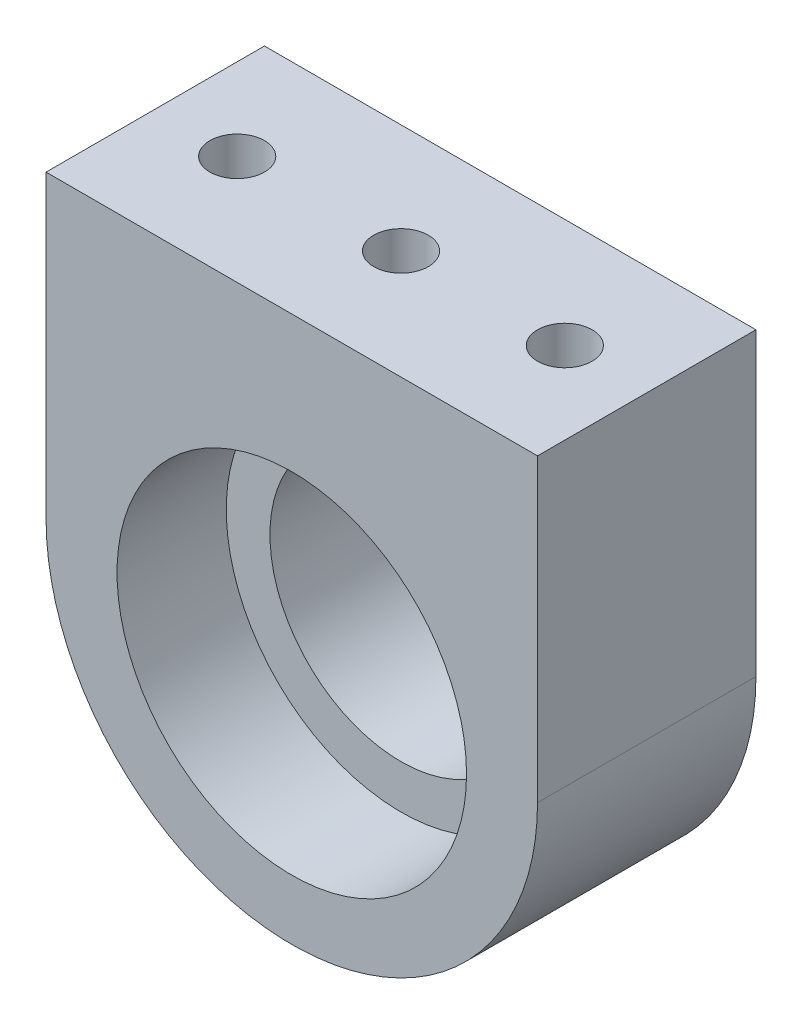
ISO-10303-21;
HEADER;
FILE_DESCRIPTION(('STEP AP214'),'2;1');
FILE_NAME('part.step','',(''),(''),'','','');
FILE_SCHEMA(('AUTOMOTIVE_DESIGN { 1 0 10303 214 1 1 1 1 }'));
ENDSEC;
DATA;
#1=APPLICATION_CONTEXT('core data for automotive mechanical design processes');
#2=APPLICATION_PROTOCOL_DEFINITION('international standard','automotive_design',2000,#1);
#3=PRODUCT_CONTEXT('',#1,'mechanical');
#4=PRODUCT('Part','Part','',(#3));
#5=PRODUCT_RELATED_PRODUCT_CATEGORY('part','',(#4));
#6=PRODUCT_DEFINITION_FORMATION('','',#4);
#7=PRODUCT_DEFINITION_CONTEXT('part definition',#1,'design');
#8=PRODUCT_DEFINITION('design','',#6,#7);
#9=PRODUCT_DEFINITION_SHAPE('','',#8);
#10=(LENGTH_UNIT() NAMED_UNIT(*) SI_UNIT(.MILLI.,.METRE.));
#11=(NAMED_UNIT(*) PLANE_ANGLE_UNIT() SI_UNIT($,.RADIAN.));
#12=(NAMED_UNIT(*) SI_UNIT($,.STERADIAN.) SOLID_ANGLE_UNIT());
#13=UNCERTAINTY_MEASURE_WITH_UNIT(LENGTH_MEASURE(1.E-05),#10,'distance_accuracy_value','');
#14=(GEOMETRIC_REPRESENTATION_CONTEXT(3) GLOBAL_UNCERTAINTY_ASSIGNED_CONTEXT((#13)) GLOBAL_UNIT_ASSIGNED_CONTEXT((#10,
#11,#12)) REPRESENTATION_CONTEXT('',''));
#15=CARTESIAN_POINT('',(0.,0.,0.));
#16=DIRECTION('',(0.,0.,1.));
#17=DIRECTION('',(1.,0.,0.));
#18=AXIS2_PLACEMENT_3D('',#15,#16,#17);
#19=CARTESIAN_POINT('',(0.,0.,10.));
#20=DIRECTION('',(0.,0.,-1.));
#21=DIRECTION('',(-1.,0.,0.));
#22=AXIS2_PLACEMENT_3D('',#19,#20,#21);
#23=PLANE('',#22);
#24=CARTESIAN_POINT('',(15.,16.75,10.));
#25=DIRECTION('',(0.,0.,1.));
#26=DIRECTION('',(1.,0.,0.));
#27=AXIS2_PLACEMENT_3D('',#24,#25,#26);
#28=CIRCLE('',#27,8.);
#29=CARTESIAN_POINT('',(23.,16.75,10.));
#30=VERTEX_POINT('',#29);
#31=EDGE_CURVE('E49',#30,#30,#28,.T.);
#32=ORIENTED_EDGE('',*,*,#31,.F.);
#33=EDGE_LOOP('',(#32));
#34=FACE_BOUND('',#33,.T.);
#35=DIRECTION('',(-1.,0.,0.));
#36=VECTOR('',#35,1.);
#37=CARTESIAN_POINT('',(26.25,31.,10.));
#38=LINE('',#37,#36);
#39=CARTESIAN_POINT('',(26.25,31.,10.));
#40=VERTEX_POINT('',#39);
#41=CARTESIAN_POINT('',(3.75000000000078,31.,10.));
#42=VERTEX_POINT('',#41);
#43=EDGE_CURVE('E117',#40,#42,#38,.T.);
#44=ORIENTED_EDGE('',*,*,#43,.T.);
#45=DIRECTION('',(0.,-1.,0.));
#46=VECTOR('',#45,1.);
#47=CARTESIAN_POINT('',(3.75000000000078,31.,10.));
#48=LINE('',#47,#46);
#49=CARTESIAN_POINT('',(3.75000000000078,17.2499999999996,10.));
#50=VERTEX_POINT('',#49);
#51=EDGE_CURVE('E132',#42,#50,#48,.T.);
#52=ORIENTED_EDGE('',*,*,#51,.T.);
#53=CARTESIAN_POINT('',(15.0000000000004,17.2499999999996,10.));
#54=DIRECTION('',(0.,0.,1.));
#55=DIRECTION('',(1.,0.,0.));
#56=AXIS2_PLACEMENT_3D('',#53,#54,#55);
#57=CIRCLE('',#56,11.2499999999996);
#58=CARTESIAN_POINT('',(26.25,17.2499999999996,10.));
#59=VERTEX_POINT('',#58);
#60=EDGE_CURVE('E57',#50,#59,#57,.T.);
#61=ORIENTED_EDGE('',*,*,#60,.T.);
#62=DIRECTION('',(0.,1.,0.));
#63=VECTOR('',#62,1.);
#64=CARTESIAN_POINT('',(26.25,17.2499999999996,10.));
#65=LINE('',#64,#63);
#66=EDGE_CURVE('E120',#59,#40,#65,.T.);
#67=ORIENTED_EDGE('',*,*,#66,.T.);
#68=EDGE_LOOP('',(#44,#52,#61,#67));
#69=FACE_BOUND('',#68,.T.);
#70=ADVANCED_FACE('F40',(#34,#69),#23,.F.);
#71=CARTESIAN_POINT('',(0.,0.,0.));
#72=DIRECTION('',(0.,0.,-1.));
#73=DIRECTION('',(-1.,0.,0.));
#74=AXIS2_PLACEMENT_3D('',#71,#72,#73);
#75=PLANE('',#74);
#76=CARTESIAN_POINT('',(15.,16.75,0.));
#77=DIRECTION('',(0.,0.,-1.));
#78=DIRECTION('',(-1.,0.,0.));
#79=AXIS2_PLACEMENT_3D('',#76,#77,#78);
#80=CIRCLE('',#79,6.);
#81=CARTESIAN_POINT('',(9.,16.75,0.));
#82=VERTEX_POINT('',#81);
#83=EDGE_CURVE('E44',#82,#82,#80,.T.);
#84=ORIENTED_EDGE('',*,*,#83,.F.);
#85=EDGE_LOOP('',(#84));
#86=FACE_BOUND('',#85,.T.);
#87=DIRECTION('',(0.,-1.,0.));
#88=VECTOR('',#87,1.);
#89=CARTESIAN_POINT('',(3.75000000000078,31.,0.));
#90=LINE('',#89,#88);
#91=CARTESIAN_POINT('',(3.75000000000078,31.,0.));
#92=VERTEX_POINT('',#91);
#93=CARTESIAN_POINT('',(3.75000000000078,17.2499999999996,0.));
#94=VERTEX_POINT('',#93);
#95=EDGE_CURVE('E119',#92,#94,#90,.T.);
#96=ORIENTED_EDGE('',*,*,#95,.F.);
#97=DIRECTION('',(-1.,0.,0.));
#98=VECTOR('',#97,1.);
#99=CARTESIAN_POINT('',(26.25,31.,0.));
#100=LINE('',#99,#98);
#101=CARTESIAN_POINT('',(26.25,31.,0.));
#102=VERTEX_POINT('',#101);
#103=EDGE_CURVE('E65',#102,#92,#100,.T.);
#104=ORIENTED_EDGE('',*,*,#103,.F.);
#105=DIRECTION('',(0.,1.,0.));
#106=VECTOR('',#105,1.);
#107=CARTESIAN_POINT('',(26.25,17.2499999999996,0.));
#108=LINE('',#107,#106);
#109=CARTESIAN_POINT('',(26.25,17.2499999999996,0.));
#110=VERTEX_POINT('',#109);
#111=EDGE_CURVE('E126',#110,#102,#108,.T.);
#112=ORIENTED_EDGE('',*,*,#111,.F.);
#113=CARTESIAN_POINT('',(15.0000000000004,17.2499999999996,0.));
#114=DIRECTION('',(0.,0.,1.));
#115=DIRECTION('',(1.,0.,0.));
#116=AXIS2_PLACEMENT_3D('',#113,#114,#115);
#117=CIRCLE('',#116,11.2499999999996);
#118=EDGE_CURVE('E123',#94,#110,#117,.T.);
#119=ORIENTED_EDGE('',*,*,#118,.F.);
#120=EDGE_LOOP('',(#96,#104,#112,#119));
#121=FACE_BOUND('',#120,.T.);
#122=ADVANCED_FACE('F42',(#86,#121),#75,.T.);
#123=CARTESIAN_POINT('',(15.,16.75,5.));
#124=DIRECTION('',(0.,0.,1.));
#125=DIRECTION('',(1.,0.,0.));
#126=AXIS2_PLACEMENT_3D('',#123,#124,#125);
#127=CYLINDRICAL_SURFACE('',#126,8.);
#128=CARTESIAN_POINT('',(15.,16.75,5.));
#129=DIRECTION('',(0.,0.,1.));
#130=DIRECTION('',(1.,0.,0.));
#131=AXIS2_PLACEMENT_3D('',#128,#129,#130);
#132=CIRCLE('',#131,8.);
#133=CARTESIAN_POINT('',(23.,16.75,5.));
#134=VERTEX_POINT('',#133);
#135=EDGE_CURVE('E11',#134,#134,#132,.T.);
#136=ORIENTED_EDGE('',*,*,#135,.F.);
#137=EDGE_LOOP('',(#136));
#138=FACE_BOUND('',#137,.T.);
#139=ORIENTED_EDGE('',*,*,#31,.T.);
#140=EDGE_LOOP('',(#139));
#141=FACE_BOUND('',#140,.T.);
#142=ADVANCED_FACE('F158',(#138,#141),#127,.F.);
#143=CARTESIAN_POINT('',(15.,16.75,5.));
#144=DIRECTION('',(0.,0.,1.));
#145=DIRECTION('',(1.,0.,0.));
#146=AXIS2_PLACEMENT_3D('',#143,#144,#145);
#147=PLANE('',#146);
#148=CARTESIAN_POINT('',(15.,16.75,5.));
#149=DIRECTION('',(0.,0.,1.));
#150=DIRECTION('',(1.,0.,0.));
#151=AXIS2_PLACEMENT_3D('',#148,#149,#150);
#152=CIRCLE('',#151,6.);
#153=CARTESIAN_POINT('',(21.,16.75,5.));
#154=VERTEX_POINT('',#153);
#155=EDGE_CURVE('E140',#154,#154,#152,.T.);
#156=ORIENTED_EDGE('',*,*,#155,.F.);
#157=EDGE_LOOP('',(#156));
#158=FACE_BOUND('',#157,.T.);
#159=ORIENTED_EDGE('',*,*,#135,.T.);
#160=EDGE_LOOP('',(#159));
#161=FACE_BOUND('',#160,.T.);
#162=ADVANCED_FACE('F188',(#158,#161),#147,.T.);
#163=CARTESIAN_POINT('',(15.,16.75,-5.));
#164=DIRECTION('',(0.,0.,1.));
#165=DIRECTION('',(1.,0.,0.));
#166=AXIS2_PLACEMENT_3D('',#163,#164,#165);
#167=CYLINDRICAL_SURFACE('',#166,6.);
#168=ORIENTED_EDGE('',*,*,#83,.T.);
#169=EDGE_LOOP('',(#168));
#170=FACE_BOUND('',#169,.T.);
#171=ORIENTED_EDGE('',*,*,#155,.T.);
#172=EDGE_LOOP('',(#171));
#173=FACE_BOUND('',#172,.T.);
#174=ADVANCED_FACE('F153',(#170,#173),#167,.F.);
#175=CARTESIAN_POINT('',(26.25,31.,0.));
#176=DIRECTION('',(0.,1.,0.));
#177=DIRECTION('',(0.,0.,1.));
#178=AXIS2_PLACEMENT_3D('',#175,#176,#177);
#179=PLANE('',#178);
#180=CARTESIAN_POINT('',(7.50000000000078,31.,5.));
#181=DIRECTION('',(0.,1.,0.));
#182=DIRECTION('',(0.,0.,1.));
#183=AXIS2_PLACEMENT_3D('',#180,#181,#182);
#184=CIRCLE('',#183,1.24999999999999);
#185=CARTESIAN_POINT('',(7.50000000000078,31.,6.24999999999999));
#186=VERTEX_POINT('',#185);
#187=EDGE_CURVE('E101',#186,#186,#184,.T.);
#188=ORIENTED_EDGE('',*,*,#187,.F.);
#189=EDGE_LOOP('',(#188));
#190=FACE_BOUND('',#189,.T.);
#191=CARTESIAN_POINT('',(15.0000000000008,31.,5.));
#192=DIRECTION('',(0.,1.,0.));
#193=DIRECTION('',(0.,0.,1.));
#194=AXIS2_PLACEMENT_3D('',#191,#192,#193);
#195=CIRCLE('',#194,1.24999999999999);
#196=CARTESIAN_POINT('',(15.0000000000008,31.,6.24999999999999));
#197=VERTEX_POINT('',#196);
#198=EDGE_CURVE('E100',#197,#197,#195,.T.);
#199=ORIENTED_EDGE('',*,*,#198,.F.);
#200=EDGE_LOOP('',(#199));
#201=FACE_BOUND('',#200,.T.);
#202=CARTESIAN_POINT('',(22.5,31.,5.));
#203=DIRECTION('',(0.,1.,0.));
#204=DIRECTION('',(0.,0.,1.));
#205=AXIS2_PLACEMENT_3D('',#202,#203,#204);
#206=CIRCLE('',#205,1.24999999999999);
#207=CARTESIAN_POINT('',(22.5,31.,6.24999999999999));
#208=VERTEX_POINT('',#207);
#209=EDGE_CURVE('E111',#208,#208,#206,.T.);
#210=ORIENTED_EDGE('',*,*,#209,.F.);
#211=EDGE_LOOP('',(#210));
#212=FACE_BOUND('',#211,.T.);
#213=ORIENTED_EDGE('',*,*,#43,.F.);
#214=DIRECTION('',(0.,0.,1.));
#215=VECTOR('',#214,1.);
#216=CARTESIAN_POINT('',(26.25,31.,0.));
#217=LINE('',#216,#215);
#218=EDGE_CURVE('E138',#102,#40,#217,.T.);
#219=ORIENTED_EDGE('',*,*,#218,.F.);
#220=ORIENTED_EDGE('',*,*,#103,.T.);
#221=DIRECTION('',(0.,0.,1.));
#222=VECTOR('',#221,1.);
#223=CARTESIAN_POINT('',(3.75000000000078,31.,0.));
#224=LINE('',#223,#222);
#225=EDGE_CURVE('E129',#92,#42,#224,.T.);
#226=ORIENTED_EDGE('',*,*,#225,.T.);
#227=EDGE_LOOP('',(#213,#219,#220,#226));
#228=FACE_BOUND('',#227,.T.);
#229=ADVANCED_FACE('F166',(#190,#201,#212,#228),#179,.T.);
#230=CARTESIAN_POINT('',(26.25,17.2499999999996,0.));
#231=DIRECTION('',(1.,0.,0.));
#232=DIRECTION('',(0.,1.,0.));
#233=AXIS2_PLACEMENT_3D('',#230,#231,#232);
#234=PLANE('',#233);
#235=ORIENTED_EDGE('',*,*,#66,.F.);
#236=DIRECTION('',(0.,0.,1.));
#237=VECTOR('',#236,1.);
#238=CARTESIAN_POINT('',(26.25,17.2499999999996,0.));
#239=LINE('',#238,#237);
#240=EDGE_CURVE('E141',#110,#59,#239,.T.);
#241=ORIENTED_EDGE('',*,*,#240,.F.);
#242=ORIENTED_EDGE('',*,*,#111,.T.);
#243=ORIENTED_EDGE('',*,*,#218,.T.);
#244=EDGE_LOOP('',(#235,#241,#242,#243));
#245=FACE_BOUND('',#244,.T.);
#246=ADVANCED_FACE('F170',(#245),#234,.T.);
#247=CARTESIAN_POINT('',(15.0000000000004,17.2499999999996,0.));
#248=DIRECTION('',(0.,0.,1.));
#249=DIRECTION('',(1.,0.,0.));
#250=AXIS2_PLACEMENT_3D('',#247,#248,#249);
#251=CYLINDRICAL_SURFACE('',#250,11.2499999999996);
#252=ORIENTED_EDGE('',*,*,#60,.F.);
#253=DIRECTION('',(0.,0.,1.));
#254=VECTOR('',#253,1.);
#255=CARTESIAN_POINT('',(3.75000000000078,17.2499999999996,0.));
#256=LINE('',#255,#254);
#257=EDGE_CURVE('E143',#94,#50,#256,.T.);
#258=ORIENTED_EDGE('',*,*,#257,.F.);
#259=ORIENTED_EDGE('',*,*,#118,.T.);
#260=ORIENTED_EDGE('',*,*,#240,.T.);
#261=EDGE_LOOP('',(#252,#258,#259,#260));
#262=FACE_BOUND('',#261,.T.);
#263=ADVANCED_FACE('F171',(#262),#251,.T.);
#264=CARTESIAN_POINT('',(3.75000000000078,31.,0.));
#265=DIRECTION('',(-1.,0.,0.));
#266=DIRECTION('',(0.,0.,1.));
#267=AXIS2_PLACEMENT_3D('',#264,#265,#266);
#268=PLANE('',#267);
#269=ORIENTED_EDGE('',*,*,#51,.F.);
#270=ORIENTED_EDGE('',*,*,#225,.F.);
#271=ORIENTED_EDGE('',*,*,#95,.T.);
#272=ORIENTED_EDGE('',*,*,#257,.T.);
#273=EDGE_LOOP('',(#269,#270,#271,#272));
#274=FACE_BOUND('',#273,.T.);
#275=ADVANCED_FACE('F164',(#274),#268,.T.);
#276=CARTESIAN_POINT('',(22.5,26.,5.));
#277=DIRECTION('',(0.,1.,0.));
#278=DIRECTION('',(0.,0.,1.));
#279=AXIS2_PLACEMENT_3D('',#276,#277,#278);
#280=CONICAL_SURFACE('',#279,1.25,1.02974425867665);
#281=CARTESIAN_POINT('',(22.5,25.2489242262156,5.));
#282=VERTEX_POINT('',#281);
#283=VERTEX_LOOP('',#282);
#284=FACE_BOUND('',#283,.T.);
#285=CARTESIAN_POINT('',(22.5,26.,5.));
#286=DIRECTION('',(0.,1.,0.));
#287=DIRECTION('',(0.,0.,1.));
#288=AXIS2_PLACEMENT_3D('',#285,#286,#287);
#289=CIRCLE('',#288,1.25);
#290=CARTESIAN_POINT('',(22.5,26.,6.25));
#291=VERTEX_POINT('',#290);
#292=EDGE_CURVE('E114',#291,#291,#289,.T.);
#293=ORIENTED_EDGE('',*,*,#292,.T.);
#294=EDGE_LOOP('',(#293));
#295=FACE_BOUND('',#294,.T.);
#296=ADVANCED_FACE('F178',(#284,#295),#280,.F.);
#297=CARTESIAN_POINT('',(22.5,31.,5.));
#298=DIRECTION('',(0.,1.,0.));
#299=DIRECTION('',(0.,0.,1.));
#300=AXIS2_PLACEMENT_3D('',#297,#298,#299);
#301=CYLINDRICAL_SURFACE('',#300,1.24999999999999);
#302=ORIENTED_EDGE('',*,*,#292,.F.);
#303=EDGE_LOOP('',(#302));
#304=FACE_BOUND('',#303,.T.);
#305=ORIENTED_EDGE('',*,*,#209,.T.);
#306=EDGE_LOOP('',(#305));
#307=FACE_BOUND('',#306,.T.);
#308=ADVANCED_FACE('F205',(#304,#307),#301,.F.);
#309=CARTESIAN_POINT('',(15.0000000000008,26.,5.));
#310=DIRECTION('',(0.,1.,0.));
#311=DIRECTION('',(0.,0.,1.));
#312=AXIS2_PLACEMENT_3D('',#309,#310,#311);
#313=CONICAL_SURFACE('',#312,1.25,1.02974425867665);
#314=CARTESIAN_POINT('',(15.0000000000008,25.2489242262156,5.));
#315=VERTEX_POINT('',#314);
#316=VERTEX_LOOP('',#315);
#317=FACE_BOUND('',#316,.T.);
#318=CARTESIAN_POINT('',(15.0000000000008,26.,5.));
#319=DIRECTION('',(0.,1.,0.));
#320=DIRECTION('',(0.,0.,1.));
#321=AXIS2_PLACEMENT_3D('',#318,#319,#320);
#322=CIRCLE('',#321,1.25);
#323=CARTESIAN_POINT('',(15.0000000000008,26.,6.25));
#324=VERTEX_POINT('',#323);
#325=EDGE_CURVE('E104',#324,#324,#322,.T.);
#326=ORIENTED_EDGE('',*,*,#325,.T.);
#327=EDGE_LOOP('',(#326));
#328=FACE_BOUND('',#327,.T.);
#329=ADVANCED_FACE('F207',(#317,#328),#313,.F.);
#330=CARTESIAN_POINT('',(15.0000000000008,31.,5.));
#331=DIRECTION('',(0.,1.,0.));
#332=DIRECTION('',(0.,0.,1.));
#333=AXIS2_PLACEMENT_3D('',#330,#331,#332);
#334=CYLINDRICAL_SURFACE('',#333,1.24999999999999);
#335=ORIENTED_EDGE('',*,*,#325,.F.);
#336=EDGE_LOOP('',(#335));
#337=FACE_BOUND('',#336,.T.);
#338=ORIENTED_EDGE('',*,*,#198,.T.);
#339=EDGE_LOOP('',(#338));
#340=FACE_BOUND('',#339,.T.);
#341=ADVANCED_FACE('F94',(#337,#340),#334,.F.);
#342=CARTESIAN_POINT('',(7.50000000000078,26.,5.));
#343=DIRECTION('',(0.,1.,0.));
#344=DIRECTION('',(0.,0.,1.));
#345=AXIS2_PLACEMENT_3D('',#342,#343,#344);
#346=CONICAL_SURFACE('',#345,1.25,1.02974425867665);
#347=CARTESIAN_POINT('',(7.50000000000078,25.2489242262156,5.));
#348=VERTEX_POINT('',#347);
#349=VERTEX_LOOP('',#348);
#350=FACE_BOUND('',#349,.T.);
#351=CARTESIAN_POINT('',(7.50000000000078,26.,5.));
#352=DIRECTION('',(0.,1.,0.));
#353=DIRECTION('',(0.,0.,1.));
#354=AXIS2_PLACEMENT_3D('',#351,#352,#353);
#355=CIRCLE('',#354,1.25);
#356=CARTESIAN_POINT('',(7.50000000000078,26.,6.25));
#357=VERTEX_POINT('',#356);
#358=EDGE_CURVE('E98',#357,#357,#355,.T.);
#359=ORIENTED_EDGE('',*,*,#358,.T.);
#360=EDGE_LOOP('',(#359));
#361=FACE_BOUND('',#360,.T.);
#362=ADVANCED_FACE('F90',(#350,#361),#346,.F.);
#363=CARTESIAN_POINT('',(7.50000000000078,31.,5.));
#364=DIRECTION('',(0.,1.,0.));
#365=DIRECTION('',(0.,0.,1.));
#366=AXIS2_PLACEMENT_3D('',#363,#364,#365);
#367=CYLINDRICAL_SURFACE('',#366,1.24999999999999);
#368=ORIENTED_EDGE('',*,*,#358,.F.);
#369=EDGE_LOOP('',(#368));
#370=FACE_BOUND('',#369,.T.);
#371=ORIENTED_EDGE('',*,*,#187,.T.);
#372=EDGE_LOOP('',(#371));
#373=FACE_BOUND('',#372,.T.);
#374=ADVANCED_FACE('F93',(#370,#373),#367,.F.);
#375=CLOSED_SHELL('',(#70,#122,#142,#162,#174,#229,#246,#263,#275,#296,#308,#329,#341,#362,#374));
#376=MANIFOLD_SOLID_BREP('B2',#375);
#377=ADVANCED_BREP_SHAPE_REPRESENTATION('',(#18,#376),#14);
#378=SHAPE_DEFINITION_REPRESENTATION(#9,#377);
ENDSEC;
END-ISO-10303-21;
